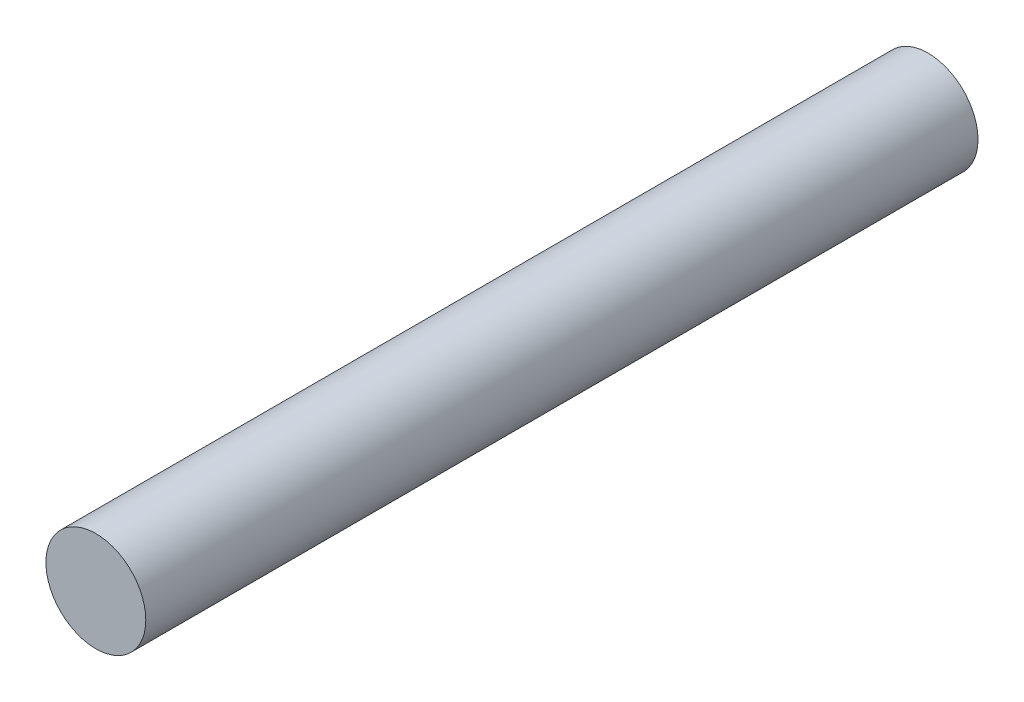
ISO-10303-21;
HEADER;
FILE_DESCRIPTION(('STEP AP214'),'2;1');
FILE_NAME('part.step','',(''),(''),'','','');
FILE_SCHEMA(('AUTOMOTIVE_DESIGN { 1 0 10303 214 1 1 1 1 }'));
ENDSEC;
DATA;
#1=APPLICATION_CONTEXT('core data for automotive mechanical design processes');
#2=APPLICATION_PROTOCOL_DEFINITION('international standard','automotive_design',2000,#1);
#3=PRODUCT_CONTEXT('',#1,'mechanical');
#4=PRODUCT('Part','Part','',(#3));
#5=PRODUCT_RELATED_PRODUCT_CATEGORY('part','',(#4));
#6=PRODUCT_DEFINITION_FORMATION('','',#4);
#7=PRODUCT_DEFINITION_CONTEXT('part definition',#1,'design');
#8=PRODUCT_DEFINITION('design','',#6,#7);
#9=PRODUCT_DEFINITION_SHAPE('','',#8);
#10=(LENGTH_UNIT() NAMED_UNIT(*) SI_UNIT(.MILLI.,.METRE.));
#11=(NAMED_UNIT(*) PLANE_ANGLE_UNIT() SI_UNIT($,.RADIAN.));
#12=(NAMED_UNIT(*) SI_UNIT($,.STERADIAN.) SOLID_ANGLE_UNIT());
#13=UNCERTAINTY_MEASURE_WITH_UNIT(LENGTH_MEASURE(1.E-05),#10,'distance_accuracy_value','');
#14=(GEOMETRIC_REPRESENTATION_CONTEXT(3) GLOBAL_UNCERTAINTY_ASSIGNED_CONTEXT((#13)) GLOBAL_UNIT_ASSIGNED_CONTEXT((#10,
#11,#12)) REPRESENTATION_CONTEXT('',''));
#15=CARTESIAN_POINT('',(0.,0.,0.));
#16=DIRECTION('',(0.,0.,1.));
#17=DIRECTION('',(1.,0.,0.));
#18=AXIS2_PLACEMENT_3D('',#15,#16,#17);
#19=CARTESIAN_POINT('',(0.,0.,50.));
#20=DIRECTION('',(0.,0.,-1.));
#21=DIRECTION('',(-1.,0.,0.));
#22=AXIS2_PLACEMENT_3D('',#19,#20,#21);
#23=CYLINDRICAL_SURFACE('',#22,3.);
#24=CARTESIAN_POINT('',(0.,0.,50.));
#25=DIRECTION('',(0.,0.,1.));
#26=DIRECTION('',(1.,0.,0.));
#27=AXIS2_PLACEMENT_3D('',#24,#25,#26);
#28=CIRCLE('',#27,3.);
#29=CARTESIAN_POINT('',(3.,0.,50.));
#30=VERTEX_POINT('',#29);
#31=EDGE_CURVE('E10',#30,#30,#28,.T.);
#32=ORIENTED_EDGE('',*,*,#31,.F.);
#33=EDGE_LOOP('',(#32));
#34=FACE_BOUND('',#33,.T.);
#35=CARTESIAN_POINT('',(0.,0.,0.));
#36=DIRECTION('',(0.,0.,1.));
#37=DIRECTION('',(1.,0.,0.));
#38=AXIS2_PLACEMENT_3D('',#35,#36,#37);
#39=CIRCLE('',#38,3.);
#40=CARTESIAN_POINT('',(3.,0.,0.));
#41=VERTEX_POINT('',#40);
#42=EDGE_CURVE('E31',#41,#41,#39,.T.);
#43=ORIENTED_EDGE('',*,*,#42,.T.);
#44=EDGE_LOOP('',(#43));
#45=FACE_BOUND('',#44,.T.);
#46=ADVANCED_FACE('F28',(#34,#45),#23,.T.);
#47=CARTESIAN_POINT('',(0.,0.,50.));
#48=DIRECTION('',(0.,0.,1.));
#49=DIRECTION('',(1.,0.,0.));
#50=AXIS2_PLACEMENT_3D('',#47,#48,#49);
#51=PLANE('',#50);
#52=ORIENTED_EDGE('',*,*,#31,.T.);
#53=EDGE_LOOP('',(#52));
#54=FACE_BOUND('',#53,.T.);
#55=ADVANCED_FACE('F43',(#54),#51,.T.);
#56=CARTESIAN_POINT('',(0.,0.,0.));
#57=DIRECTION('',(0.,0.,1.));
#58=DIRECTION('',(1.,0.,0.));
#59=AXIS2_PLACEMENT_3D('',#56,#57,#58);
#60=PLANE('',#59);
#61=ORIENTED_EDGE('',*,*,#42,.F.);
#62=EDGE_LOOP('',(#61));
#63=FACE_BOUND('',#62,.T.);
#64=ADVANCED_FACE('F41',(#63),#60,.F.);
#65=CLOSED_SHELL('',(#46,#55,#64));
#66=MANIFOLD_SOLID_BREP('B2',#65);
#67=ADVANCED_BREP_SHAPE_REPRESENTATION('',(#18,#66),#14);
#68=SHAPE_DEFINITION_REPRESENTATION(#9,#67);
ENDSEC;
END-ISO-10303-21;
